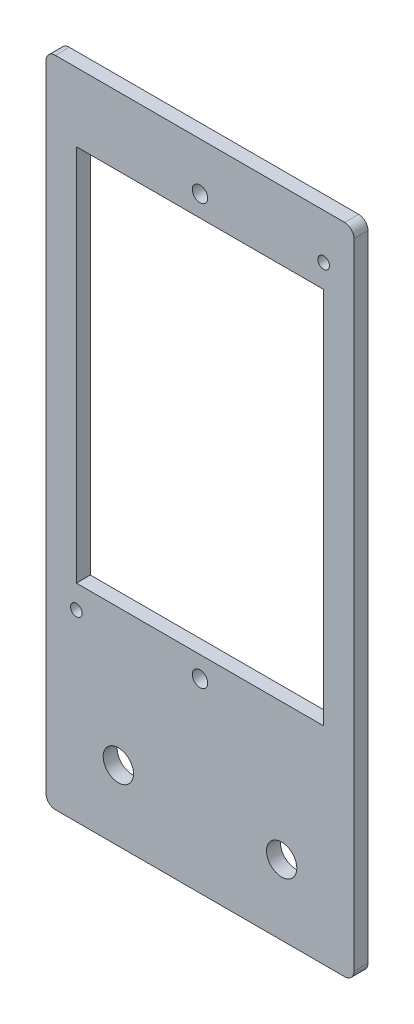
ISO-10303-21;
HEADER;
FILE_DESCRIPTION(('STEP AP214'),'2;1');
FILE_NAME('part.step','',(''),(''),'','','');
FILE_SCHEMA(('AUTOMOTIVE_DESIGN { 1 0 10303 214 1 1 1 1 }'));
ENDSEC;
DATA;
#1=APPLICATION_CONTEXT('core data for automotive mechanical design processes');
#2=APPLICATION_PROTOCOL_DEFINITION('international standard','automotive_design',2000,#1);
#3=PRODUCT_CONTEXT('',#1,'mechanical');
#4=PRODUCT('Part','Part','',(#3));
#5=PRODUCT_RELATED_PRODUCT_CATEGORY('part','',(#4));
#6=PRODUCT_DEFINITION_FORMATION('','',#4);
#7=PRODUCT_DEFINITION_CONTEXT('part definition',#1,'design');
#8=PRODUCT_DEFINITION('design','',#6,#7);
#9=PRODUCT_DEFINITION_SHAPE('','',#8);
#10=(LENGTH_UNIT() NAMED_UNIT(*) SI_UNIT(.MILLI.,.METRE.));
#11=(NAMED_UNIT(*) PLANE_ANGLE_UNIT() SI_UNIT($,.RADIAN.));
#12=(NAMED_UNIT(*) SI_UNIT($,.STERADIAN.) SOLID_ANGLE_UNIT());
#13=UNCERTAINTY_MEASURE_WITH_UNIT(LENGTH_MEASURE(1.E-05),#10,'distance_accuracy_value','');
#14=(GEOMETRIC_REPRESENTATION_CONTEXT(3) GLOBAL_UNCERTAINTY_ASSIGNED_CONTEXT((#13)) GLOBAL_UNIT_ASSIGNED_CONTEXT((#10,
#11,#12)) REPRESENTATION_CONTEXT('',''));
#15=CARTESIAN_POINT('',(0.,0.,0.));
#16=DIRECTION('',(0.,0.,1.));
#17=DIRECTION('',(1.,0.,0.));
#18=AXIS2_PLACEMENT_3D('',#15,#16,#17);
#19=CARTESIAN_POINT('',(0.,0.,3.));
#20=DIRECTION('',(0.,0.,1.));
#21=DIRECTION('',(1.,0.,0.));
#22=AXIS2_PLACEMENT_3D('',#19,#20,#21);
#23=PLANE('',#22);
#24=CARTESIAN_POINT('',(48.6448126374118,15.6327137546468,3.));
#25=DIRECTION('',(0.,0.,1.));
#26=DIRECTION('',(1.,0.,0.));
#27=AXIS2_PLACEMENT_3D('',#24,#25,#26);
#28=CIRCLE('',#27,1.25);
#29=CARTESIAN_POINT('',(49.8948126374118,15.6327137546468,3.));
#30=VERTEX_POINT('',#29);
#31=EDGE_CURVE('E424',#30,#30,#28,.T.);
#32=ORIENTED_EDGE('',*,*,#31,.F.);
#33=EDGE_LOOP('',(#32));
#34=FACE_BOUND('',#33,.T.);
#35=CARTESIAN_POINT('',(-4.35518736258818,-75.3672862453532,3.));
#36=DIRECTION('',(0.,0.,1.));
#37=DIRECTION('',(1.,0.,0.));
#38=AXIS2_PLACEMENT_3D('',#35,#36,#37);
#39=CIRCLE('',#38,1.25);
#40=CARTESIAN_POINT('',(-3.10518736258818,-75.3672862453532,3.));
#41=VERTEX_POINT('',#40);
#42=EDGE_CURVE('E426',#41,#41,#39,.T.);
#43=ORIENTED_EDGE('',*,*,#42,.F.);
#44=EDGE_LOOP('',(#43));
#45=FACE_BOUND('',#44,.T.);
#46=CARTESIAN_POINT('',(22.1448126374118,15.1327137546468,3.));
#47=DIRECTION('',(0.,0.,1.));
#48=DIRECTION('',(1.,0.,0.));
#49=AXIS2_PLACEMENT_3D('',#46,#47,#48);
#50=CIRCLE('',#49,1.64999999999999);
#51=CARTESIAN_POINT('',(23.7948126374118,15.1327137546468,3.));
#52=VERTEX_POINT('',#51);
#53=EDGE_CURVE('E434',#52,#52,#50,.T.);
#54=ORIENTED_EDGE('',*,*,#53,.F.);
#55=EDGE_LOOP('',(#54));
#56=FACE_BOUND('',#55,.T.);
#57=CARTESIAN_POINT('',(22.1448126374118,-74.8672862453532,3.));
#58=DIRECTION('',(0.,0.,1.));
#59=DIRECTION('',(1.,0.,0.));
#60=AXIS2_PLACEMENT_3D('',#57,#58,#59);
#61=CIRCLE('',#60,1.64999999999999);
#62=CARTESIAN_POINT('',(23.7948126374118,-74.8672862453532,3.));
#63=VERTEX_POINT('',#62);
#64=EDGE_CURVE('E440',#63,#63,#61,.T.);
#65=ORIENTED_EDGE('',*,*,#64,.F.);
#66=EDGE_LOOP('',(#65));
#67=FACE_BOUND('',#66,.T.);
#68=CARTESIAN_POINT('',(4.64481263741186,-99.6672862453532,3.));
#69=DIRECTION('',(0.,0.,1.));
#70=DIRECTION('',(1.,0.,0.));
#71=AXIS2_PLACEMENT_3D('',#68,#69,#70);
#72=CIRCLE('',#71,3.25);
#73=CARTESIAN_POINT('',(7.89481263741186,-99.6672862453532,3.));
#74=VERTEX_POINT('',#73);
#75=EDGE_CURVE('E159',#74,#74,#72,.T.);
#76=ORIENTED_EDGE('',*,*,#75,.F.);
#77=EDGE_LOOP('',(#76));
#78=FACE_BOUND('',#77,.T.);
#79=DIRECTION('',(0.,-1.,0.));
#80=VECTOR('',#79,1.);
#81=CARTESIAN_POINT('',(-10.8551873625882,25.3327137546468,3.));
#82=LINE('',#81,#80);
#83=CARTESIAN_POINT('',(-10.8551873625882,23.3327137546468,3.));
#84=VERTEX_POINT('',#83);
#85=CARTESIAN_POINT('',(-10.8551873625882,-112.667286245353,3.));
#86=VERTEX_POINT('',#85);
#87=EDGE_CURVE('E170',#84,#86,#82,.T.);
#88=ORIENTED_EDGE('',*,*,#87,.T.);
#89=CARTESIAN_POINT('',(-8.85518736258816,-112.667286245353,3.));
#90=DIRECTION('',(0.,0.,1.));
#91=DIRECTION('',(1.,0.,0.));
#92=AXIS2_PLACEMENT_3D('',#89,#90,#91);
#93=CIRCLE('',#92,2.);
#94=CARTESIAN_POINT('',(-8.85518736258816,-114.667286245353,3.));
#95=VERTEX_POINT('',#94);
#96=EDGE_CURVE('E213',#86,#95,#93,.T.);
#97=ORIENTED_EDGE('',*,*,#96,.T.);
#98=DIRECTION('',(1.,0.,0.));
#99=VECTOR('',#98,1.);
#100=CARTESIAN_POINT('',(-10.8551873625882,-114.667286245353,3.));
#101=LINE('',#100,#99);
#102=CARTESIAN_POINT('',(53.1448126374118,-114.667286245353,3.));
#103=VERTEX_POINT('',#102);
#104=EDGE_CURVE('E173',#95,#103,#101,.T.);
#105=ORIENTED_EDGE('',*,*,#104,.T.);
#106=CARTESIAN_POINT('',(53.1448126374118,-112.667286245353,3.));
#107=DIRECTION('',(0.,0.,1.));
#108=DIRECTION('',(1.,0.,0.));
#109=AXIS2_PLACEMENT_3D('',#106,#107,#108);
#110=CIRCLE('',#109,2.);
#111=CARTESIAN_POINT('',(55.1448126374118,-112.667286245353,3.));
#112=VERTEX_POINT('',#111);
#113=EDGE_CURVE('E211',#103,#112,#110,.T.);
#114=ORIENTED_EDGE('',*,*,#113,.T.);
#115=DIRECTION('',(0.,1.,0.));
#116=VECTOR('',#115,1.);
#117=CARTESIAN_POINT('',(55.1448126374118,25.3327137546468,3.));
#118=LINE('',#117,#116);
#119=CARTESIAN_POINT('',(55.1448126374118,23.3327137546468,3.));
#120=VERTEX_POINT('',#119);
#121=EDGE_CURVE('E177',#112,#120,#118,.T.);
#122=ORIENTED_EDGE('',*,*,#121,.T.);
#123=CARTESIAN_POINT('',(53.1448126374118,23.3327137546468,3.));
#124=DIRECTION('',(0.,0.,1.));
#125=DIRECTION('',(1.,0.,0.));
#126=AXIS2_PLACEMENT_3D('',#123,#124,#125);
#127=CIRCLE('',#126,2.);
#128=CARTESIAN_POINT('',(53.1448126374118,25.3327137546468,3.));
#129=VERTEX_POINT('',#128);
#130=EDGE_CURVE('E56',#120,#129,#127,.T.);
#131=ORIENTED_EDGE('',*,*,#130,.T.);
#132=DIRECTION('',(-1.,0.,0.));
#133=VECTOR('',#132,1.);
#134=CARTESIAN_POINT('',(-10.8551873625882,25.3327137546468,3.));
#135=LINE('',#134,#133);
#136=CARTESIAN_POINT('',(-8.85518736258818,25.3327137546468,3.));
#137=VERTEX_POINT('',#136);
#138=EDGE_CURVE('E179',#129,#137,#135,.T.);
#139=ORIENTED_EDGE('',*,*,#138,.T.);
#140=CARTESIAN_POINT('',(-8.85518736258818,23.3327137546468,3.));
#141=DIRECTION('',(0.,0.,1.));
#142=DIRECTION('',(1.,0.,0.));
#143=AXIS2_PLACEMENT_3D('',#140,#141,#142);
#144=CIRCLE('',#143,2.);
#145=EDGE_CURVE('E208',#137,#84,#144,.T.);
#146=ORIENTED_EDGE('',*,*,#145,.T.);
#147=EDGE_LOOP('',(#88,#97,#105,#114,#122,#131,#139,#146));
#148=FACE_BOUND('',#147,.T.);
#149=DIRECTION('',(1.,0.,0.));
#150=VECTOR('',#149,1.);
#151=CARTESIAN_POINT('',(-4.35518736258817,-70.3672862453532,3.));
#152=LINE('',#151,#150);
#153=CARTESIAN_POINT('',(-4.35518736258817,-70.3672862453532,3.));
#154=VERTEX_POINT('',#153);
#155=CARTESIAN_POINT('',(48.6448126374118,-70.3672862453532,3.));
#156=VERTEX_POINT('',#155);
#157=EDGE_CURVE('E136',#154,#156,#152,.T.);
#158=ORIENTED_EDGE('',*,*,#157,.F.);
#159=DIRECTION('',(0.,-1.,0.));
#160=VECTOR('',#159,1.);
#161=CARTESIAN_POINT('',(-4.35518736258818,10.6327137546468,3.));
#162=LINE('',#161,#160);
#163=CARTESIAN_POINT('',(-4.35518736258818,10.6327137546468,3.));
#164=VERTEX_POINT('',#163);
#165=EDGE_CURVE('E126',#164,#154,#162,.T.);
#166=ORIENTED_EDGE('',*,*,#165,.F.);
#167=DIRECTION('',(-1.,0.,0.));
#168=VECTOR('',#167,1.);
#169=CARTESIAN_POINT('',(-4.35518736258818,10.6327137546468,3.));
#170=LINE('',#169,#168);
#171=CARTESIAN_POINT('',(48.6448126374118,10.6327137546468,3.));
#172=VERTEX_POINT('',#171);
#173=EDGE_CURVE('E152',#172,#164,#170,.T.);
#174=ORIENTED_EDGE('',*,*,#173,.F.);
#175=DIRECTION('',(0.,1.,0.));
#176=VECTOR('',#175,1.);
#177=CARTESIAN_POINT('',(48.6448126374118,10.6327137546468,3.));
#178=LINE('',#177,#176);
#179=EDGE_CURVE('E150',#156,#172,#178,.T.);
#180=ORIENTED_EDGE('',*,*,#179,.F.);
#181=EDGE_LOOP('',(#158,#166,#174,#180));
#182=FACE_BOUND('',#181,.T.);
#183=CARTESIAN_POINT('',(39.6448126374119,-99.6672862453532,3.));
#184=DIRECTION('',(0.,0.,1.));
#185=DIRECTION('',(1.,0.,0.));
#186=AXIS2_PLACEMENT_3D('',#183,#184,#185);
#187=CIRCLE('',#186,3.25);
#188=CARTESIAN_POINT('',(42.8948126374119,-99.6672862453532,3.));
#189=VERTEX_POINT('',#188);
#190=EDGE_CURVE('E447',#189,#189,#187,.T.);
#191=ORIENTED_EDGE('',*,*,#190,.F.);
#192=EDGE_LOOP('',(#191));
#193=FACE_BOUND('',#192,.T.);
#194=ADVANCED_FACE('F35',(#34,#45,#56,#67,#78,#148,#182,#193),#23,.T.);
#195=CARTESIAN_POINT('',(0.,0.,0.));
#196=DIRECTION('',(0.,0.,1.));
#197=DIRECTION('',(1.,0.,0.));
#198=AXIS2_PLACEMENT_3D('',#195,#196,#197);
#199=PLANE('',#198);
#200=CARTESIAN_POINT('',(48.6448126374118,15.6327137546468,0.));
#201=DIRECTION('',(0.,0.,1.));
#202=DIRECTION('',(1.,0.,0.));
#203=AXIS2_PLACEMENT_3D('',#200,#201,#202);
#204=CIRCLE('',#203,1.25);
#205=CARTESIAN_POINT('',(49.8948126374118,15.6327137546468,0.));
#206=VERTEX_POINT('',#205);
#207=EDGE_CURVE('E422',#206,#206,#204,.T.);
#208=ORIENTED_EDGE('',*,*,#207,.T.);
#209=EDGE_LOOP('',(#208));
#210=FACE_BOUND('',#209,.T.);
#211=CARTESIAN_POINT('',(-4.35518736258818,-75.3672862453532,0.));
#212=DIRECTION('',(0.,0.,1.));
#213=DIRECTION('',(1.,0.,0.));
#214=AXIS2_PLACEMENT_3D('',#211,#212,#213);
#215=CIRCLE('',#214,1.25);
#216=CARTESIAN_POINT('',(-3.10518736258818,-75.3672862453532,0.));
#217=VERTEX_POINT('',#216);
#218=EDGE_CURVE('E431',#217,#217,#215,.T.);
#219=ORIENTED_EDGE('',*,*,#218,.T.);
#220=EDGE_LOOP('',(#219));
#221=FACE_BOUND('',#220,.T.);
#222=CARTESIAN_POINT('',(22.1448126374118,15.1327137546468,0.));
#223=DIRECTION('',(0.,0.,1.));
#224=DIRECTION('',(1.,0.,0.));
#225=AXIS2_PLACEMENT_3D('',#222,#223,#224);
#226=CIRCLE('',#225,1.65);
#227=CARTESIAN_POINT('',(23.7948126374118,15.1327137546468,0.));
#228=VERTEX_POINT('',#227);
#229=EDGE_CURVE('E437',#228,#228,#226,.T.);
#230=ORIENTED_EDGE('',*,*,#229,.T.);
#231=EDGE_LOOP('',(#230));
#232=FACE_BOUND('',#231,.T.);
#233=CARTESIAN_POINT('',(22.1448126374118,-74.8672862453532,0.));
#234=DIRECTION('',(0.,0.,1.));
#235=DIRECTION('',(1.,0.,0.));
#236=AXIS2_PLACEMENT_3D('',#233,#234,#235);
#237=CIRCLE('',#236,1.65);
#238=CARTESIAN_POINT('',(23.7948126374118,-74.8672862453532,0.));
#239=VERTEX_POINT('',#238);
#240=EDGE_CURVE('E443',#239,#239,#237,.T.);
#241=ORIENTED_EDGE('',*,*,#240,.T.);
#242=EDGE_LOOP('',(#241));
#243=FACE_BOUND('',#242,.T.);
#244=DIRECTION('',(1.,0.,0.));
#245=VECTOR('',#244,1.);
#246=CARTESIAN_POINT('',(-10.8551873625882,-114.667286245353,0.));
#247=LINE('',#246,#245);
#248=CARTESIAN_POINT('',(-8.85518736258816,-114.667286245353,0.));
#249=VERTEX_POINT('',#248);
#250=CARTESIAN_POINT('',(53.1448126374118,-114.667286245353,0.));
#251=VERTEX_POINT('',#250);
#252=EDGE_CURVE('E184',#249,#251,#247,.T.);
#253=ORIENTED_EDGE('',*,*,#252,.F.);
#254=CARTESIAN_POINT('',(-8.85518736258816,-112.667286245353,0.));
#255=DIRECTION('',(0.,0.,1.));
#256=DIRECTION('',(1.,0.,0.));
#257=AXIS2_PLACEMENT_3D('',#254,#255,#256);
#258=CIRCLE('',#257,2.);
#259=CARTESIAN_POINT('',(-10.8551873625882,-112.667286245353,0.));
#260=VERTEX_POINT('',#259);
#261=EDGE_CURVE('E201',#249,#260,#258,.F.);
#262=ORIENTED_EDGE('',*,*,#261,.T.);
#263=DIRECTION('',(0.,-1.,0.));
#264=VECTOR('',#263,1.);
#265=CARTESIAN_POINT('',(-10.8551873625882,25.3327137546468,0.));
#266=LINE('',#265,#264);
#267=CARTESIAN_POINT('',(-10.8551873625882,23.3327137546468,0.));
#268=VERTEX_POINT('',#267);
#269=EDGE_CURVE('E144',#268,#260,#266,.T.);
#270=ORIENTED_EDGE('',*,*,#269,.F.);
#271=CARTESIAN_POINT('',(-8.85518736258818,23.3327137546468,0.));
#272=DIRECTION('',(0.,0.,1.));
#273=DIRECTION('',(1.,0.,0.));
#274=AXIS2_PLACEMENT_3D('',#271,#272,#273);
#275=CIRCLE('',#274,2.);
#276=CARTESIAN_POINT('',(-8.85518736258818,25.3327137546468,0.));
#277=VERTEX_POINT('',#276);
#278=EDGE_CURVE('E195',#268,#277,#275,.F.);
#279=ORIENTED_EDGE('',*,*,#278,.T.);
#280=DIRECTION('',(-1.,0.,0.));
#281=VECTOR('',#280,1.);
#282=CARTESIAN_POINT('',(-10.8551873625882,25.3327137546468,0.));
#283=LINE('',#282,#281);
#284=CARTESIAN_POINT('',(53.1448126374118,25.3327137546468,0.));
#285=VERTEX_POINT('',#284);
#286=EDGE_CURVE('E174',#285,#277,#283,.T.);
#287=ORIENTED_EDGE('',*,*,#286,.F.);
#288=CARTESIAN_POINT('',(53.1448126374118,23.3327137546468,0.));
#289=DIRECTION('',(0.,0.,1.));
#290=DIRECTION('',(1.,0.,0.));
#291=AXIS2_PLACEMENT_3D('',#288,#289,#290);
#292=CIRCLE('',#291,2.);
#293=CARTESIAN_POINT('',(55.1448126374118,23.3327137546468,0.));
#294=VERTEX_POINT('',#293);
#295=EDGE_CURVE('E197',#285,#294,#292,.F.);
#296=ORIENTED_EDGE('',*,*,#295,.T.);
#297=DIRECTION('',(0.,1.,0.));
#298=VECTOR('',#297,1.);
#299=CARTESIAN_POINT('',(55.1448126374118,25.3327137546468,0.));
#300=LINE('',#299,#298);
#301=CARTESIAN_POINT('',(55.1448126374118,-112.667286245353,0.));
#302=VERTEX_POINT('',#301);
#303=EDGE_CURVE('E187',#302,#294,#300,.T.);
#304=ORIENTED_EDGE('',*,*,#303,.F.);
#305=CARTESIAN_POINT('',(53.1448126374118,-112.667286245353,0.));
#306=DIRECTION('',(0.,0.,1.));
#307=DIRECTION('',(1.,0.,0.));
#308=AXIS2_PLACEMENT_3D('',#305,#306,#307);
#309=CIRCLE('',#308,2.);
#310=EDGE_CURVE('E199',#302,#251,#309,.F.);
#311=ORIENTED_EDGE('',*,*,#310,.T.);
#312=EDGE_LOOP('',(#253,#262,#270,#279,#287,#296,#304,#311));
#313=FACE_BOUND('',#312,.T.);
#314=DIRECTION('',(0.,-1.,0.));
#315=VECTOR('',#314,1.);
#316=CARTESIAN_POINT('',(-4.35518736258818,10.6327137546468,0.));
#317=LINE('',#316,#315);
#318=CARTESIAN_POINT('',(-4.35518736258818,10.6327137546468,0.));
#319=VERTEX_POINT('',#318);
#320=CARTESIAN_POINT('',(-4.35518736258817,-70.3672862453532,0.));
#321=VERTEX_POINT('',#320);
#322=EDGE_CURVE('E157',#319,#321,#317,.T.);
#323=ORIENTED_EDGE('',*,*,#322,.T.);
#324=DIRECTION('',(1.,0.,0.));
#325=VECTOR('',#324,1.);
#326=CARTESIAN_POINT('',(-4.35518736258817,-70.3672862453532,0.));
#327=LINE('',#326,#325);
#328=CARTESIAN_POINT('',(48.6448126374118,-70.3672862453532,0.));
#329=VERTEX_POINT('',#328);
#330=EDGE_CURVE('E143',#321,#329,#327,.T.);
#331=ORIENTED_EDGE('',*,*,#330,.T.);
#332=DIRECTION('',(0.,1.,0.));
#333=VECTOR('',#332,1.);
#334=CARTESIAN_POINT('',(48.6448126374118,10.6327137546468,0.));
#335=LINE('',#334,#333);
#336=CARTESIAN_POINT('',(48.6448126374118,10.6327137546468,0.));
#337=VERTEX_POINT('',#336);
#338=EDGE_CURVE('E161',#329,#337,#335,.T.);
#339=ORIENTED_EDGE('',*,*,#338,.T.);
#340=DIRECTION('',(-1.,0.,0.));
#341=VECTOR('',#340,1.);
#342=CARTESIAN_POINT('',(-4.35518736258818,10.6327137546468,0.));
#343=LINE('',#342,#341);
#344=EDGE_CURVE('E137',#337,#319,#343,.T.);
#345=ORIENTED_EDGE('',*,*,#344,.T.);
#346=EDGE_LOOP('',(#323,#331,#339,#345));
#347=FACE_BOUND('',#346,.T.);
#348=CARTESIAN_POINT('',(4.64481263741186,-99.6672862453532,0.));
#349=DIRECTION('',(0.,0.,1.));
#350=DIRECTION('',(1.,0.,0.));
#351=AXIS2_PLACEMENT_3D('',#348,#349,#350);
#352=CIRCLE('',#351,3.25);
#353=CARTESIAN_POINT('',(7.89481263741186,-99.6672862453532,0.));
#354=VERTEX_POINT('',#353);
#355=EDGE_CURVE('E450',#354,#354,#352,.T.);
#356=ORIENTED_EDGE('',*,*,#355,.T.);
#357=EDGE_LOOP('',(#356));
#358=FACE_BOUND('',#357,.T.);
#359=CARTESIAN_POINT('',(39.6448126374119,-99.6672862453532,0.));
#360=DIRECTION('',(0.,0.,1.));
#361=DIRECTION('',(1.,0.,0.));
#362=AXIS2_PLACEMENT_3D('',#359,#360,#361);
#363=CIRCLE('',#362,3.25);
#364=CARTESIAN_POINT('',(42.8948126374119,-99.6672862453532,0.));
#365=VERTEX_POINT('',#364);
#366=EDGE_CURVE('E446',#365,#365,#363,.T.);
#367=ORIENTED_EDGE('',*,*,#366,.T.);
#368=EDGE_LOOP('',(#367));
#369=FACE_BOUND('',#368,.T.);
#370=ADVANCED_FACE('F229',(#210,#221,#232,#243,#313,#347,#358,#369),#199,.F.);
#371=CARTESIAN_POINT('',(-10.8551873625882,25.3327137546468,3.));
#372=DIRECTION('',(1.,0.,0.));
#373=DIRECTION('',(0.,1.,0.));
#374=AXIS2_PLACEMENT_3D('',#371,#372,#373);
#375=PLANE('',#374);
#376=ORIENTED_EDGE('',*,*,#269,.T.);
#377=DIRECTION('',(0.,0.,-1.));
#378=VECTOR('',#377,1.);
#379=CARTESIAN_POINT('',(-10.8551873625882,-112.667286245353,3.));
#380=LINE('',#379,#378);
#381=EDGE_CURVE('E206',#260,#86,#380,.F.);
#382=ORIENTED_EDGE('',*,*,#381,.T.);
#383=ORIENTED_EDGE('',*,*,#87,.F.);
#384=DIRECTION('',(0.,0.,-1.));
#385=VECTOR('',#384,1.);
#386=CARTESIAN_POINT('',(-10.8551873625882,23.3327137546468,3.));
#387=LINE('',#386,#385);
#388=EDGE_CURVE('E203',#84,#268,#387,.T.);
#389=ORIENTED_EDGE('',*,*,#388,.T.);
#390=EDGE_LOOP('',(#376,#382,#383,#389));
#391=FACE_BOUND('',#390,.T.);
#392=ADVANCED_FACE('F242',(#391),#375,.F.);
#393=CARTESIAN_POINT('',(-10.8551873625882,-114.667286245353,3.));
#394=DIRECTION('',(0.,1.,0.));
#395=DIRECTION('',(0.,0.,1.));
#396=AXIS2_PLACEMENT_3D('',#393,#394,#395);
#397=PLANE('',#396);
#398=ORIENTED_EDGE('',*,*,#104,.F.);
#399=DIRECTION('',(0.,0.,-1.));
#400=VECTOR('',#399,1.);
#401=CARTESIAN_POINT('',(-8.85518736258816,-114.667286245353,3.));
#402=LINE('',#401,#400);
#403=EDGE_CURVE('E192',#95,#249,#402,.T.);
#404=ORIENTED_EDGE('',*,*,#403,.T.);
#405=ORIENTED_EDGE('',*,*,#252,.T.);
#406=DIRECTION('',(0.,0.,-1.));
#407=VECTOR('',#406,1.);
#408=CARTESIAN_POINT('',(53.1448126374118,-114.667286245353,3.));
#409=LINE('',#408,#407);
#410=EDGE_CURVE('E181',#251,#103,#409,.F.);
#411=ORIENTED_EDGE('',*,*,#410,.T.);
#412=EDGE_LOOP('',(#398,#404,#405,#411));
#413=FACE_BOUND('',#412,.T.);
#414=ADVANCED_FACE('F250',(#413),#397,.F.);
#415=CARTESIAN_POINT('',(55.1448126374118,25.3327137546468,3.));
#416=DIRECTION('',(-1.,0.,0.));
#417=DIRECTION('',(0.,-1.,0.));
#418=AXIS2_PLACEMENT_3D('',#415,#416,#417);
#419=PLANE('',#418);
#420=ORIENTED_EDGE('',*,*,#121,.F.);
#421=DIRECTION('',(0.,0.,-1.));
#422=VECTOR('',#421,1.);
#423=CARTESIAN_POINT('',(55.1448126374118,-112.667286245353,3.));
#424=LINE('',#423,#422);
#425=EDGE_CURVE('E217',#112,#302,#424,.T.);
#426=ORIENTED_EDGE('',*,*,#425,.T.);
#427=ORIENTED_EDGE('',*,*,#303,.T.);
#428=DIRECTION('',(0.,0.,-1.));
#429=VECTOR('',#428,1.);
#430=CARTESIAN_POINT('',(55.1448126374118,23.3327137546468,3.));
#431=LINE('',#430,#429);
#432=EDGE_CURVE('E215',#294,#120,#431,.F.);
#433=ORIENTED_EDGE('',*,*,#432,.T.);
#434=EDGE_LOOP('',(#420,#426,#427,#433));
#435=FACE_BOUND('',#434,.T.);
#436=ADVANCED_FACE('F223',(#435),#419,.F.);
#437=CARTESIAN_POINT('',(-10.8551873625882,25.3327137546468,3.));
#438=DIRECTION('',(0.,-1.,0.));
#439=DIRECTION('',(1.,0.,0.));
#440=AXIS2_PLACEMENT_3D('',#437,#438,#439);
#441=PLANE('',#440);
#442=ORIENTED_EDGE('',*,*,#138,.F.);
#443=DIRECTION('',(0.,0.,-1.));
#444=VECTOR('',#443,1.);
#445=CARTESIAN_POINT('',(53.1448126374118,25.3327137546468,3.));
#446=LINE('',#445,#444);
#447=EDGE_CURVE('E11',#129,#285,#446,.T.);
#448=ORIENTED_EDGE('',*,*,#447,.T.);
#449=ORIENTED_EDGE('',*,*,#286,.T.);
#450=DIRECTION('',(0.,0.,-1.));
#451=VECTOR('',#450,1.);
#452=CARTESIAN_POINT('',(-8.85518736258818,25.3327137546468,3.));
#453=LINE('',#452,#451);
#454=EDGE_CURVE('E43',#277,#137,#453,.F.);
#455=ORIENTED_EDGE('',*,*,#454,.T.);
#456=EDGE_LOOP('',(#442,#448,#449,#455));
#457=FACE_BOUND('',#456,.T.);
#458=ADVANCED_FACE('F235',(#457),#441,.F.);
#459=CARTESIAN_POINT('',(-4.35518736258818,10.6327137546468,3.));
#460=DIRECTION('',(1.,0.,0.));
#461=DIRECTION('',(0.,1.,0.));
#462=AXIS2_PLACEMENT_3D('',#459,#460,#461);
#463=PLANE('',#462);
#464=ORIENTED_EDGE('',*,*,#322,.F.);
#465=DIRECTION('',(0.,0.,-1.));
#466=VECTOR('',#465,1.);
#467=CARTESIAN_POINT('',(-4.35518736258818,10.6327137546468,3.));
#468=LINE('',#467,#466);
#469=EDGE_CURVE('E132',#164,#319,#468,.T.);
#470=ORIENTED_EDGE('',*,*,#469,.F.);
#471=ORIENTED_EDGE('',*,*,#165,.T.);
#472=DIRECTION('',(0.,0.,-1.));
#473=VECTOR('',#472,1.);
#474=CARTESIAN_POINT('',(-4.35518736258817,-70.3672862453532,3.));
#475=LINE('',#474,#473);
#476=EDGE_CURVE('E129',#154,#321,#475,.T.);
#477=ORIENTED_EDGE('',*,*,#476,.T.);
#478=EDGE_LOOP('',(#464,#470,#471,#477));
#479=FACE_BOUND('',#478,.T.);
#480=ADVANCED_FACE('F128',(#479),#463,.T.);
#481=CARTESIAN_POINT('',(-4.35518736258817,-70.3672862453532,3.));
#482=DIRECTION('',(0.,1.,0.));
#483=DIRECTION('',(0.,0.,1.));
#484=AXIS2_PLACEMENT_3D('',#481,#482,#483);
#485=PLANE('',#484);
#486=ORIENTED_EDGE('',*,*,#330,.F.);
#487=ORIENTED_EDGE('',*,*,#476,.F.);
#488=ORIENTED_EDGE('',*,*,#157,.T.);
#489=DIRECTION('',(0.,0.,-1.));
#490=VECTOR('',#489,1.);
#491=CARTESIAN_POINT('',(48.6448126374118,-70.3672862453532,3.));
#492=LINE('',#491,#490);
#493=EDGE_CURVE('E145',#156,#329,#492,.T.);
#494=ORIENTED_EDGE('',*,*,#493,.T.);
#495=EDGE_LOOP('',(#486,#487,#488,#494));
#496=FACE_BOUND('',#495,.T.);
#497=ADVANCED_FACE('F140',(#496),#485,.T.);
#498=CARTESIAN_POINT('',(48.6448126374118,10.6327137546468,3.));
#499=DIRECTION('',(-1.,0.,0.));
#500=DIRECTION('',(0.,-1.,0.));
#501=AXIS2_PLACEMENT_3D('',#498,#499,#500);
#502=PLANE('',#501);
#503=ORIENTED_EDGE('',*,*,#338,.F.);
#504=ORIENTED_EDGE('',*,*,#493,.F.);
#505=ORIENTED_EDGE('',*,*,#179,.T.);
#506=DIRECTION('',(0.,0.,-1.));
#507=VECTOR('',#506,1.);
#508=CARTESIAN_POINT('',(48.6448126374118,10.6327137546468,3.));
#509=LINE('',#508,#507);
#510=EDGE_CURVE('E167',#172,#337,#509,.T.);
#511=ORIENTED_EDGE('',*,*,#510,.T.);
#512=EDGE_LOOP('',(#503,#504,#505,#511));
#513=FACE_BOUND('',#512,.T.);
#514=ADVANCED_FACE('F310',(#513),#502,.T.);
#515=CARTESIAN_POINT('',(-4.35518736258818,10.6327137546468,3.));
#516=DIRECTION('',(0.,-1.,0.));
#517=DIRECTION('',(0.,0.,-1.));
#518=AXIS2_PLACEMENT_3D('',#515,#516,#517);
#519=PLANE('',#518);
#520=ORIENTED_EDGE('',*,*,#344,.F.);
#521=ORIENTED_EDGE('',*,*,#510,.F.);
#522=ORIENTED_EDGE('',*,*,#173,.T.);
#523=ORIENTED_EDGE('',*,*,#469,.T.);
#524=EDGE_LOOP('',(#520,#521,#522,#523));
#525=FACE_BOUND('',#524,.T.);
#526=ADVANCED_FACE('F316',(#525),#519,.T.);
#527=CARTESIAN_POINT('',(4.64481263741186,-99.6672862453532,3.));
#528=DIRECTION('',(0.,0.,-1.));
#529=DIRECTION('',(-1.,0.,0.));
#530=AXIS2_PLACEMENT_3D('',#527,#528,#529);
#531=CYLINDRICAL_SURFACE('',#530,3.25);
#532=ORIENTED_EDGE('',*,*,#75,.T.);
#533=EDGE_LOOP('',(#532));
#534=FACE_BOUND('',#533,.T.);
#535=ORIENTED_EDGE('',*,*,#355,.F.);
#536=EDGE_LOOP('',(#535));
#537=FACE_BOUND('',#536,.T.);
#538=ADVANCED_FACE('F324',(#534,#537),#531,.F.);
#539=CARTESIAN_POINT('',(39.6448126374119,-99.6672862453532,3.));
#540=DIRECTION('',(0.,0.,-1.));
#541=DIRECTION('',(-1.,0.,0.));
#542=AXIS2_PLACEMENT_3D('',#539,#540,#541);
#543=CYLINDRICAL_SURFACE('',#542,3.25);
#544=ORIENTED_EDGE('',*,*,#190,.T.);
#545=EDGE_LOOP('',(#544));
#546=FACE_BOUND('',#545,.T.);
#547=ORIENTED_EDGE('',*,*,#366,.F.);
#548=EDGE_LOOP('',(#547));
#549=FACE_BOUND('',#548,.T.);
#550=ADVANCED_FACE('F259',(#546,#549),#543,.F.);
#551=CARTESIAN_POINT('',(-8.85518736258816,-112.667286245353,3.));
#552=DIRECTION('',(0.,0.,-1.));
#553=DIRECTION('',(-1.,0.,0.));
#554=AXIS2_PLACEMENT_3D('',#551,#552,#553);
#555=CYLINDRICAL_SURFACE('',#554,2.);
#556=ORIENTED_EDGE('',*,*,#96,.F.);
#557=ORIENTED_EDGE('',*,*,#381,.F.);
#558=ORIENTED_EDGE('',*,*,#261,.F.);
#559=ORIENTED_EDGE('',*,*,#403,.F.);
#560=EDGE_LOOP('',(#556,#557,#558,#559));
#561=FACE_BOUND('',#560,.T.);
#562=ADVANCED_FACE('F247',(#561),#555,.T.);
#563=CARTESIAN_POINT('',(53.1448126374118,-112.667286245353,3.));
#564=DIRECTION('',(0.,0.,-1.));
#565=DIRECTION('',(-1.,0.,0.));
#566=AXIS2_PLACEMENT_3D('',#563,#564,#565);
#567=CYLINDRICAL_SURFACE('',#566,2.);
#568=ORIENTED_EDGE('',*,*,#113,.F.);
#569=ORIENTED_EDGE('',*,*,#410,.F.);
#570=ORIENTED_EDGE('',*,*,#310,.F.);
#571=ORIENTED_EDGE('',*,*,#425,.F.);
#572=EDGE_LOOP('',(#568,#569,#570,#571));
#573=FACE_BOUND('',#572,.T.);
#574=ADVANCED_FACE('F252',(#573),#567,.T.);
#575=CARTESIAN_POINT('',(53.1448126374118,23.3327137546468,3.));
#576=DIRECTION('',(0.,0.,-1.));
#577=DIRECTION('',(-1.,0.,0.));
#578=AXIS2_PLACEMENT_3D('',#575,#576,#577);
#579=CYLINDRICAL_SURFACE('',#578,2.);
#580=ORIENTED_EDGE('',*,*,#130,.F.);
#581=ORIENTED_EDGE('',*,*,#432,.F.);
#582=ORIENTED_EDGE('',*,*,#295,.F.);
#583=ORIENTED_EDGE('',*,*,#447,.F.);
#584=EDGE_LOOP('',(#580,#581,#582,#583));
#585=FACE_BOUND('',#584,.T.);
#586=ADVANCED_FACE('F234',(#585),#579,.T.);
#587=CARTESIAN_POINT('',(-8.85518736258818,23.3327137546468,3.));
#588=DIRECTION('',(0.,0.,-1.));
#589=DIRECTION('',(-1.,0.,0.));
#590=AXIS2_PLACEMENT_3D('',#587,#588,#589);
#591=CYLINDRICAL_SURFACE('',#590,2.);
#592=ORIENTED_EDGE('',*,*,#145,.F.);
#593=ORIENTED_EDGE('',*,*,#454,.F.);
#594=ORIENTED_EDGE('',*,*,#278,.F.);
#595=ORIENTED_EDGE('',*,*,#388,.F.);
#596=EDGE_LOOP('',(#592,#593,#594,#595));
#597=FACE_BOUND('',#596,.T.);
#598=ADVANCED_FACE('F37',(#597),#591,.T.);
#599=CARTESIAN_POINT('',(22.1448126374118,-74.8672862453532,3.));
#600=DIRECTION('',(0.,0.,1.));
#601=DIRECTION('',(1.,0.,0.));
#602=AXIS2_PLACEMENT_3D('',#599,#600,#601);
#603=CYLINDRICAL_SURFACE('',#602,1.64999999999999);
#604=ORIENTED_EDGE('',*,*,#240,.F.);
#605=EDGE_LOOP('',(#604));
#606=FACE_BOUND('',#605,.T.);
#607=ORIENTED_EDGE('',*,*,#64,.T.);
#608=EDGE_LOOP('',(#607));
#609=FACE_BOUND('',#608,.T.);
#610=ADVANCED_FACE('F361',(#606,#609),#603,.F.);
#611=CARTESIAN_POINT('',(22.1448126374118,15.1327137546468,3.));
#612=DIRECTION('',(0.,0.,1.));
#613=DIRECTION('',(1.,0.,0.));
#614=AXIS2_PLACEMENT_3D('',#611,#612,#613);
#615=CYLINDRICAL_SURFACE('',#614,1.64999999999999);
#616=ORIENTED_EDGE('',*,*,#229,.F.);
#617=EDGE_LOOP('',(#616));
#618=FACE_BOUND('',#617,.T.);
#619=ORIENTED_EDGE('',*,*,#53,.T.);
#620=EDGE_LOOP('',(#619));
#621=FACE_BOUND('',#620,.T.);
#622=ADVANCED_FACE('F370',(#618,#621),#615,.F.);
#623=CARTESIAN_POINT('',(-4.35518736258818,-75.3672862453532,3.));
#624=DIRECTION('',(0.,0.,1.));
#625=DIRECTION('',(1.,0.,0.));
#626=AXIS2_PLACEMENT_3D('',#623,#624,#625);
#627=CYLINDRICAL_SURFACE('',#626,1.25);
#628=ORIENTED_EDGE('',*,*,#218,.F.);
#629=EDGE_LOOP('',(#628));
#630=FACE_BOUND('',#629,.T.);
#631=ORIENTED_EDGE('',*,*,#42,.T.);
#632=EDGE_LOOP('',(#631));
#633=FACE_BOUND('',#632,.T.);
#634=ADVANCED_FACE('F381',(#630,#633),#627,.F.);
#635=CARTESIAN_POINT('',(48.6448126374118,15.6327137546468,3.));
#636=DIRECTION('',(0.,0.,1.));
#637=DIRECTION('',(1.,0.,0.));
#638=AXIS2_PLACEMENT_3D('',#635,#636,#637);
#639=CYLINDRICAL_SURFACE('',#638,1.25);
#640=ORIENTED_EDGE('',*,*,#207,.F.);
#641=EDGE_LOOP('',(#640));
#642=FACE_BOUND('',#641,.T.);
#643=ORIENTED_EDGE('',*,*,#31,.T.);
#644=EDGE_LOOP('',(#643));
#645=FACE_BOUND('',#644,.T.);
#646=ADVANCED_FACE('F401',(#642,#645),#639,.F.);
#647=CLOSED_SHELL('',(#194,#370,#392,#414,#436,#458,#480,#497,#514,#526,#538,#550,#562,#574,
#586,#598,#610,#622,#634,#646));
#648=MANIFOLD_SOLID_BREP('B2',#647);
#649=ADVANCED_BREP_SHAPE_REPRESENTATION('',(#18,#648),#14);
#650=SHAPE_DEFINITION_REPRESENTATION(#9,#649);
ENDSEC;
END-ISO-10303-21;
